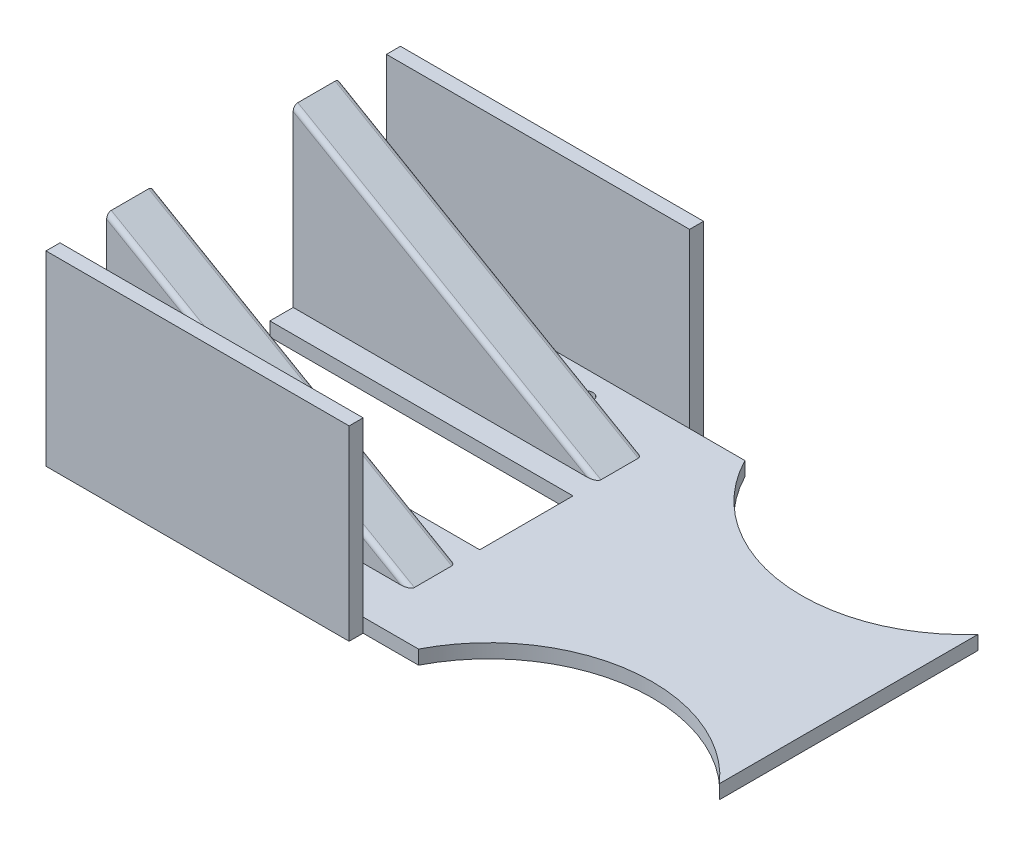
ISO-10303-21;
HEADER;
FILE_DESCRIPTION(('STEP AP214'),'2;1');
FILE_NAME('part.step','',(''),(''),'','','');
FILE_SCHEMA(('AUTOMOTIVE_DESIGN { 1 0 10303 214 1 1 1 1 }'));
ENDSEC;
DATA;
#1=APPLICATION_CONTEXT('core data for automotive mechanical design processes');
#2=APPLICATION_PROTOCOL_DEFINITION('international standard','automotive_design',2000,#1);
#3=PRODUCT_CONTEXT('',#1,'mechanical');
#4=PRODUCT('Part','Part','',(#3));
#5=PRODUCT_RELATED_PRODUCT_CATEGORY('part','',(#4));
#6=PRODUCT_DEFINITION_FORMATION('','',#4);
#7=PRODUCT_DEFINITION_CONTEXT('part definition',#1,'design');
#8=PRODUCT_DEFINITION('design','',#6,#7);
#9=PRODUCT_DEFINITION_SHAPE('','',#8);
#10=(LENGTH_UNIT() NAMED_UNIT(*) SI_UNIT(.MILLI.,.METRE.));
#11=(NAMED_UNIT(*) PLANE_ANGLE_UNIT() SI_UNIT($,.RADIAN.));
#12=(NAMED_UNIT(*) SI_UNIT($,.STERADIAN.) SOLID_ANGLE_UNIT());
#13=UNCERTAINTY_MEASURE_WITH_UNIT(LENGTH_MEASURE(1.E-05),#10,'distance_accuracy_value','');
#14=(GEOMETRIC_REPRESENTATION_CONTEXT(3) GLOBAL_UNCERTAINTY_ASSIGNED_CONTEXT((#13)) GLOBAL_UNIT_ASSIGNED_CONTEXT((#10,
#11,#12)) REPRESENTATION_CONTEXT('',''));
#15=CARTESIAN_POINT('',(0.,0.,0.));
#16=DIRECTION('',(0.,0.,1.));
#17=DIRECTION('',(1.,0.,0.));
#18=AXIS2_PLACEMENT_3D('',#15,#16,#17);
#19=CARTESIAN_POINT('',(0.,3.,0.));
#20=DIRECTION('',(0.,1.,0.));
#21=DIRECTION('',(0.,0.,1.));
#22=AXIS2_PLACEMENT_3D('',#19,#20,#21);
#23=PLANE('',#22);
#24=CARTESIAN_POINT('',(-74.7667848025547,3.,-29.8600592254599));
#25=DIRECTION('',(0.,1.,0.));
#26=DIRECTION('',(0.,0.,1.));
#27=AXIS2_PLACEMENT_3D('',#24,#25,#26);
#28=CIRCLE('',#27,1.5);
#29=CARTESIAN_POINT('',(-74.7667848025547,3.,-28.3600592254599));
#30=VERTEX_POINT('',#29);
#31=EDGE_CURVE('E568',#30,#30,#28,.T.);
#32=ORIENTED_EDGE('',*,*,#31,.F.);
#33=EDGE_LOOP('',(#32));
#34=FACE_BOUND('',#33,.T.);
#35=CARTESIAN_POINT('',(-54.7667848025547,3.,-29.8600592254599));
#36=DIRECTION('',(0.,1.,0.));
#37=DIRECTION('',(0.,0.,1.));
#38=AXIS2_PLACEMENT_3D('',#35,#36,#37);
#39=CIRCLE('',#38,1.5);
#40=CARTESIAN_POINT('',(-54.7667848025547,3.,-28.3600592254599));
#41=VERTEX_POINT('',#40);
#42=EDGE_CURVE('E593',#41,#41,#39,.T.);
#43=ORIENTED_EDGE('',*,*,#42,.F.);
#44=EDGE_LOOP('',(#43));
#45=FACE_BOUND('',#44,.T.);
#46=CARTESIAN_POINT('',(-34.7667848025547,3.,-29.8600592254599));
#47=DIRECTION('',(0.,1.,0.));
#48=DIRECTION('',(0.,0.,1.));
#49=AXIS2_PLACEMENT_3D('',#46,#47,#48);
#50=CIRCLE('',#49,1.5);
#51=CARTESIAN_POINT('',(-34.7667848025547,3.,-28.3600592254599));
#52=VERTEX_POINT('',#51);
#53=EDGE_CURVE('E585',#52,#52,#50,.T.);
#54=ORIENTED_EDGE('',*,*,#53,.F.);
#55=EDGE_LOOP('',(#54));
#56=FACE_BOUND('',#55,.T.);
#57=CARTESIAN_POINT('',(-34.7667848025547,3.,29.8600592254599));
#58=DIRECTION('',(0.,1.,0.));
#59=DIRECTION('',(0.,0.,-1.));
#60=AXIS2_PLACEMENT_3D('',#57,#58,#59);
#61=CIRCLE('',#60,1.5);
#62=CARTESIAN_POINT('',(-34.7667848025547,3.,28.3600592254599));
#63=VERTEX_POINT('',#62);
#64=EDGE_CURVE('E576',#63,#63,#61,.T.);
#65=ORIENTED_EDGE('',*,*,#64,.F.);
#66=EDGE_LOOP('',(#65));
#67=FACE_BOUND('',#66,.T.);
#68=CARTESIAN_POINT('',(-54.7667848025547,3.,29.8600592254599));
#69=DIRECTION('',(0.,1.,0.));
#70=DIRECTION('',(0.,0.,-1.));
#71=AXIS2_PLACEMENT_3D('',#68,#69,#70);
#72=CIRCLE('',#71,1.5);
#73=CARTESIAN_POINT('',(-54.7667848025547,3.,28.3600592254599));
#74=VERTEX_POINT('',#73);
#75=EDGE_CURVE('E609',#74,#74,#72,.T.);
#76=ORIENTED_EDGE('',*,*,#75,.F.);
#77=EDGE_LOOP('',(#76));
#78=FACE_BOUND('',#77,.T.);
#79=CARTESIAN_POINT('',(-74.7667848025547,3.,29.8600592254599));
#80=DIRECTION('',(0.,1.,0.));
#81=DIRECTION('',(0.,0.,-1.));
#82=AXIS2_PLACEMENT_3D('',#79,#80,#81);
#83=CIRCLE('',#82,1.5);
#84=CARTESIAN_POINT('',(-74.7667848025547,3.,28.3600592254599));
#85=VERTEX_POINT('',#84);
#86=EDGE_CURVE('E600',#85,#85,#83,.T.);
#87=ORIENTED_EDGE('',*,*,#86,.F.);
#88=EDGE_LOOP('',(#87));
#89=FACE_BOUND('',#88,.T.);
#90=CARTESIAN_POINT('',(25.2953736654804,3.,51.));
#91=DIRECTION('',(0.,1.,0.));
#92=DIRECTION('',(0.,0.,-1.));
#93=AXIS2_PLACEMENT_3D('',#90,#91,#92);
#94=CIRCLE('',#93,35.);
#95=CARTESIAN_POINT('',(51.4241384980272,3.,27.7129295890301));
#96=VERTEX_POINT('',#95);
#97=CARTESIAN_POINT('',(-5.83339116706635,3.,35.));
#98=VERTEX_POINT('',#97);
#99=EDGE_CURVE('E406',#96,#98,#94,.T.);
#100=ORIENTED_EDGE('',*,*,#99,.F.);
#101=DIRECTION('',(0.,0.,-1.));
#102=VECTOR('',#101,1.);
#103=CARTESIAN_POINT('',(51.4241384980272,3.,0.));
#104=LINE('',#103,#102);
#105=CARTESIAN_POINT('',(51.4241384980272,3.,-27.7129295890301));
#106=VERTEX_POINT('',#105);
#107=EDGE_CURVE('E221',#96,#106,#104,.T.);
#108=ORIENTED_EDGE('',*,*,#107,.T.);
#109=CARTESIAN_POINT('',(25.2953736654804,3.,-51.));
#110=DIRECTION('',(0.,1.,0.));
#111=DIRECTION('',(0.,0.,1.));
#112=AXIS2_PLACEMENT_3D('',#109,#110,#111);
#113=CIRCLE('',#112,35.);
#114=CARTESIAN_POINT('',(-5.83339116706635,3.,-35.));
#115=VERTEX_POINT('',#114);
#116=EDGE_CURVE('E409',#115,#106,#113,.T.);
#117=ORIENTED_EDGE('',*,*,#116,.F.);
#118=DIRECTION('',(-1.,0.,0.));
#119=VECTOR('',#118,1.);
#120=CARTESIAN_POINT('',(-82.7046263345196,3.,-35.));
#121=LINE('',#120,#119);
#122=CARTESIAN_POINT('',(-17.7046263345196,3.,-35.));
#123=VERTEX_POINT('',#122);
#124=EDGE_CURVE('E343',#115,#123,#121,.T.);
#125=ORIENTED_EDGE('',*,*,#124,.T.);
#126=DIRECTION('',(1.,0.,0.));
#127=VECTOR('',#126,1.);
#128=CARTESIAN_POINT('',(0.,3.,-35.));
#129=LINE('',#128,#127);
#130=CARTESIAN_POINT('',(-82.7046263345196,3.,-35.));
#131=VERTEX_POINT('',#130);
#132=EDGE_CURVE('E388',#131,#123,#129,.T.);
#133=ORIENTED_EDGE('',*,*,#132,.F.);
#134=DIRECTION('',(0.,0.,1.));
#135=VECTOR('',#134,1.);
#136=CARTESIAN_POINT('',(-82.7046263345196,3.,35.));
#137=LINE('',#136,#135);
#138=CARTESIAN_POINT('',(-82.7046263345196,3.,-25.));
#139=VERTEX_POINT('',#138);
#140=EDGE_CURVE('E348',#131,#139,#137,.T.);
#141=ORIENTED_EDGE('',*,*,#140,.T.);
#142=DIRECTION('',(1.,0.,0.));
#143=VECTOR('',#142,1.);
#144=CARTESIAN_POINT('',(-82.7046263345196,3.,-25.));
#145=LINE('',#144,#143);
#146=CARTESIAN_POINT('',(-19.7046263345196,3.,-25.));
#147=VERTEX_POINT('',#146);
#148=EDGE_CURVE('E340',#139,#147,#145,.T.);
#149=ORIENTED_EDGE('',*,*,#148,.T.);
#150=CARTESIAN_POINT('',(-19.7046263345196,3.,-24.));
#151=DIRECTION('',(0.,1.,0.));
#152=DIRECTION('',(-1.,0.,0.));
#153=AXIS2_PLACEMENT_3D('',#150,#151,#152);
#154=ELLIPSE('',#153,2.,1.);
#155=CARTESIAN_POINT('',(-17.7046263345196,3.,-24.));
#156=VERTEX_POINT('',#155);
#157=EDGE_CURVE('E297',#147,#156,#154,.F.);
#158=ORIENTED_EDGE('',*,*,#157,.T.);
#159=DIRECTION('',(0.,0.,1.));
#160=VECTOR('',#159,1.);
#161=CARTESIAN_POINT('',(-17.7046263345196,3.,-25.));
#162=LINE('',#161,#160);
#163=CARTESIAN_POINT('',(-17.7046263345196,3.,-16.));
#164=VERTEX_POINT('',#163);
#165=EDGE_CURVE('E308',#156,#164,#162,.T.);
#166=ORIENTED_EDGE('',*,*,#165,.T.);
#167=CARTESIAN_POINT('',(-19.7046263345196,3.,-16.));
#168=DIRECTION('',(0.,1.,0.));
#169=DIRECTION('',(1.,0.,0.));
#170=AXIS2_PLACEMENT_3D('',#167,#168,#169);
#171=ELLIPSE('',#170,2.,1.);
#172=CARTESIAN_POINT('',(-19.7046263345196,3.,-15.));
#173=VERTEX_POINT('',#172);
#174=EDGE_CURVE('E50',#164,#173,#171,.F.);
#175=ORIENTED_EDGE('',*,*,#174,.T.);
#176=DIRECTION('',(-1.,0.,0.));
#177=VECTOR('',#176,1.);
#178=CARTESIAN_POINT('',(137.29537366548,3.,-15.));
#179=LINE('',#178,#177);
#180=CARTESIAN_POINT('',(-82.7046263345196,3.,-15.));
#181=VERTEX_POINT('',#180);
#182=EDGE_CURVE('E305',#173,#181,#179,.T.);
#183=ORIENTED_EDGE('',*,*,#182,.T.);
#184=DIRECTION('',(0.,0.,1.));
#185=VECTOR('',#184,1.);
#186=CARTESIAN_POINT('',(-82.7046263345196,3.,-15.));
#187=LINE('',#186,#185);
#188=CARTESIAN_POINT('',(-82.7046263345196,3.,-10.));
#189=VERTEX_POINT('',#188);
#190=EDGE_CURVE('E424',#181,#189,#187,.T.);
#191=ORIENTED_EDGE('',*,*,#190,.T.);
#192=DIRECTION('',(-1.,0.,0.));
#193=VECTOR('',#192,1.);
#194=CARTESIAN_POINT('',(-82.7046263345196,3.,-10.));
#195=LINE('',#194,#193);
#196=CARTESIAN_POINT('',(-17.7046263345196,3.,-10.));
#197=VERTEX_POINT('',#196);
#198=EDGE_CURVE('E633',#197,#189,#195,.T.);
#199=ORIENTED_EDGE('',*,*,#198,.F.);
#200=DIRECTION('',(0.,0.,-1.));
#201=VECTOR('',#200,1.);
#202=CARTESIAN_POINT('',(-17.7046263345196,3.,-10.));
#203=LINE('',#202,#201);
#204=CARTESIAN_POINT('',(-17.7046263345196,3.,10.));
#205=VERTEX_POINT('',#204);
#206=EDGE_CURVE('E626',#205,#197,#203,.T.);
#207=ORIENTED_EDGE('',*,*,#206,.F.);
#208=DIRECTION('',(1.,0.,0.));
#209=VECTOR('',#208,1.);
#210=CARTESIAN_POINT('',(-82.7046263345196,3.,10.));
#211=LINE('',#210,#209);
#212=CARTESIAN_POINT('',(-82.7046263345196,3.,10.));
#213=VERTEX_POINT('',#212);
#214=EDGE_CURVE('E515',#213,#205,#211,.T.);
#215=ORIENTED_EDGE('',*,*,#214,.F.);
#216=CARTESIAN_POINT('',(-82.7046263345196,3.,15.));
#217=VERTEX_POINT('',#216);
#218=EDGE_CURVE('E423',#213,#217,#187,.T.);
#219=ORIENTED_EDGE('',*,*,#218,.T.);
#220=DIRECTION('',(-1.,0.,0.));
#221=VECTOR('',#220,1.);
#222=CARTESIAN_POINT('',(137.29537366548,3.,15.));
#223=LINE('',#222,#221);
#224=CARTESIAN_POINT('',(-19.7046263345196,3.,15.));
#225=VERTEX_POINT('',#224);
#226=EDGE_CURVE('E318',#225,#217,#223,.T.);
#227=ORIENTED_EDGE('',*,*,#226,.F.);
#228=CARTESIAN_POINT('',(-19.7046263345196,3.,16.));
#229=DIRECTION('',(0.,1.,0.));
#230=DIRECTION('',(-1.,0.,0.));
#231=AXIS2_PLACEMENT_3D('',#228,#229,#230);
#232=ELLIPSE('',#231,2.,1.);
#233=CARTESIAN_POINT('',(-17.7046263345196,3.,16.));
#234=VERTEX_POINT('',#233);
#235=EDGE_CURVE('E11',#225,#234,#232,.F.);
#236=ORIENTED_EDGE('',*,*,#235,.T.);
#237=CARTESIAN_POINT('',(-17.7046263345196,3.,24.));
#238=VERTEX_POINT('',#237);
#239=EDGE_CURVE('E332',#234,#238,#162,.T.);
#240=ORIENTED_EDGE('',*,*,#239,.T.);
#241=CARTESIAN_POINT('',(-19.7046263345196,3.,24.));
#242=DIRECTION('',(0.,1.,0.));
#243=DIRECTION('',(1.,0.,0.));
#244=AXIS2_PLACEMENT_3D('',#241,#242,#243);
#245=ELLIPSE('',#244,2.,1.);
#246=CARTESIAN_POINT('',(-19.7046263345196,3.,25.));
#247=VERTEX_POINT('',#246);
#248=EDGE_CURVE('E294',#238,#247,#245,.F.);
#249=ORIENTED_EDGE('',*,*,#248,.T.);
#250=DIRECTION('',(1.,0.,0.));
#251=VECTOR('',#250,1.);
#252=CARTESIAN_POINT('',(-82.7046263345196,3.,25.));
#253=LINE('',#252,#251);
#254=CARTESIAN_POINT('',(-82.7046263345196,3.,25.));
#255=VERTEX_POINT('',#254);
#256=EDGE_CURVE('E436',#255,#247,#253,.T.);
#257=ORIENTED_EDGE('',*,*,#256,.F.);
#258=CARTESIAN_POINT('',(-82.7046263345196,3.,35.));
#259=VERTEX_POINT('',#258);
#260=EDGE_CURVE('E347',#255,#259,#137,.T.);
#261=ORIENTED_EDGE('',*,*,#260,.T.);
#262=DIRECTION('',(1.,0.,0.));
#263=VECTOR('',#262,1.);
#264=CARTESIAN_POINT('',(-82.7046263345196,3.,35.));
#265=LINE('',#264,#263);
#266=CARTESIAN_POINT('',(-17.7046263345196,3.,35.));
#267=VERTEX_POINT('',#266);
#268=EDGE_CURVE('E242',#259,#267,#265,.T.);
#269=ORIENTED_EDGE('',*,*,#268,.T.);
#270=EDGE_CURVE('E249',#267,#98,#265,.T.);
#271=ORIENTED_EDGE('',*,*,#270,.T.);
#272=EDGE_LOOP('',(#100,#108,#117,#125,#133,#141,#149,#158,#166,#175,#183,#191,#199,#207,#215,
#219,#227,#236,#240,#249,#257,#261,#269,#271));
#273=FACE_BOUND('',#272,.T.);
#274=ADVANCED_FACE('F41',(#34,#45,#56,#67,#78,#89,#273),#23,.T.);
#275=CARTESIAN_POINT('',(0.,0.,0.));
#276=DIRECTION('',(0.,1.,0.));
#277=DIRECTION('',(0.,0.,1.));
#278=AXIS2_PLACEMENT_3D('',#275,#276,#277);
#279=PLANE('',#278);
#280=CARTESIAN_POINT('',(-74.7667848025547,0.,-29.8600592254599));
#281=DIRECTION('',(0.,1.,0.));
#282=DIRECTION('',(0.,0.,1.));
#283=AXIS2_PLACEMENT_3D('',#280,#281,#282);
#284=CIRCLE('',#283,1.5);
#285=CARTESIAN_POINT('',(-74.7667848025547,0.,-28.3600592254599));
#286=VERTEX_POINT('',#285);
#287=EDGE_CURVE('E553',#286,#286,#284,.T.);
#288=ORIENTED_EDGE('',*,*,#287,.T.);
#289=EDGE_LOOP('',(#288));
#290=FACE_BOUND('',#289,.T.);
#291=CARTESIAN_POINT('',(-54.7667848025547,0.,-29.8600592254599));
#292=DIRECTION('',(0.,1.,0.));
#293=DIRECTION('',(0.,0.,1.));
#294=AXIS2_PLACEMENT_3D('',#291,#292,#293);
#295=CIRCLE('',#294,1.5);
#296=CARTESIAN_POINT('',(-54.7667848025547,0.,-28.3600592254599));
#297=VERTEX_POINT('',#296);
#298=EDGE_CURVE('E572',#297,#297,#295,.T.);
#299=ORIENTED_EDGE('',*,*,#298,.T.);
#300=EDGE_LOOP('',(#299));
#301=FACE_BOUND('',#300,.T.);
#302=CARTESIAN_POINT('',(-34.7667848025547,0.,-29.8600592254599));
#303=DIRECTION('',(0.,1.,0.));
#304=DIRECTION('',(0.,0.,1.));
#305=AXIS2_PLACEMENT_3D('',#302,#303,#304);
#306=CIRCLE('',#305,1.5);
#307=CARTESIAN_POINT('',(-34.7667848025547,0.,-28.3600592254599));
#308=VERTEX_POINT('',#307);
#309=EDGE_CURVE('E589',#308,#308,#306,.T.);
#310=ORIENTED_EDGE('',*,*,#309,.T.);
#311=EDGE_LOOP('',(#310));
#312=FACE_BOUND('',#311,.T.);
#313=CARTESIAN_POINT('',(-34.7667848025547,0.,29.8600592254599));
#314=DIRECTION('',(0.,1.,0.));
#315=DIRECTION('',(0.,0.,-1.));
#316=AXIS2_PLACEMENT_3D('',#313,#314,#315);
#317=CIRCLE('',#316,1.5);
#318=CARTESIAN_POINT('',(-34.7667848025547,0.,28.3600592254599));
#319=VERTEX_POINT('',#318);
#320=EDGE_CURVE('E580',#319,#319,#317,.T.);
#321=ORIENTED_EDGE('',*,*,#320,.T.);
#322=EDGE_LOOP('',(#321));
#323=FACE_BOUND('',#322,.T.);
#324=CARTESIAN_POINT('',(-54.7667848025547,0.,29.8600592254599));
#325=DIRECTION('',(0.,1.,0.));
#326=DIRECTION('',(0.,0.,-1.));
#327=AXIS2_PLACEMENT_3D('',#324,#325,#326);
#328=CIRCLE('',#327,1.5);
#329=CARTESIAN_POINT('',(-54.7667848025547,0.,28.3600592254599));
#330=VERTEX_POINT('',#329);
#331=EDGE_CURVE('E581',#330,#330,#328,.T.);
#332=ORIENTED_EDGE('',*,*,#331,.T.);
#333=EDGE_LOOP('',(#332));
#334=FACE_BOUND('',#333,.T.);
#335=CARTESIAN_POINT('',(-74.7667848025547,0.,29.8600592254599));
#336=DIRECTION('',(0.,1.,0.));
#337=DIRECTION('',(0.,0.,-1.));
#338=AXIS2_PLACEMENT_3D('',#335,#336,#337);
#339=CIRCLE('',#338,1.5);
#340=CARTESIAN_POINT('',(-74.7667848025547,0.,28.3600592254599));
#341=VERTEX_POINT('',#340);
#342=EDGE_CURVE('E604',#341,#341,#339,.T.);
#343=ORIENTED_EDGE('',*,*,#342,.T.);
#344=EDGE_LOOP('',(#343));
#345=FACE_BOUND('',#344,.T.);
#346=DIRECTION('',(0.,0.,-1.));
#347=VECTOR('',#346,1.);
#348=CARTESIAN_POINT('',(51.4241384980272,0.,0.));
#349=LINE('',#348,#347);
#350=CARTESIAN_POINT('',(51.4241384980272,0.,27.7129295890301));
#351=VERTEX_POINT('',#350);
#352=CARTESIAN_POINT('',(51.4241384980272,0.,-27.7129295890301));
#353=VERTEX_POINT('',#352);
#354=EDGE_CURVE('E57',#351,#353,#349,.T.);
#355=ORIENTED_EDGE('',*,*,#354,.F.);
#356=CARTESIAN_POINT('',(25.2953736654804,0.,51.));
#357=DIRECTION('',(0.,1.,0.));
#358=DIRECTION('',(0.,0.,1.));
#359=AXIS2_PLACEMENT_3D('',#356,#357,#358);
#360=CIRCLE('',#359,35.);
#361=CARTESIAN_POINT('',(-5.83339116706635,0.,35.));
#362=VERTEX_POINT('',#361);
#363=EDGE_CURVE('E231',#351,#362,#360,.T.);
#364=ORIENTED_EDGE('',*,*,#363,.T.);
#365=DIRECTION('',(1.,0.,0.));
#366=VECTOR('',#365,1.);
#367=CARTESIAN_POINT('',(-82.7046263345196,0.,35.));
#368=LINE('',#367,#366);
#369=CARTESIAN_POINT('',(-17.7046263345196,0.,35.));
#370=VERTEX_POINT('',#369);
#371=EDGE_CURVE('E252',#370,#362,#368,.T.);
#372=ORIENTED_EDGE('',*,*,#371,.F.);
#373=DIRECTION('',(0.,0.,1.));
#374=VECTOR('',#373,1.);
#375=CARTESIAN_POINT('',(-17.7046263345196,0.,38.));
#376=LINE('',#375,#374);
#377=CARTESIAN_POINT('',(-17.7046263345196,0.,38.));
#378=VERTEX_POINT('',#377);
#379=EDGE_CURVE('E376',#370,#378,#376,.T.);
#380=ORIENTED_EDGE('',*,*,#379,.T.);
#381=DIRECTION('',(-1.,0.,0.));
#382=VECTOR('',#381,1.);
#383=CARTESIAN_POINT('',(-17.7046263345196,0.,38.));
#384=LINE('',#383,#382);
#385=CARTESIAN_POINT('',(-82.7046263345196,0.,38.));
#386=VERTEX_POINT('',#385);
#387=EDGE_CURVE('E374',#378,#386,#384,.T.);
#388=ORIENTED_EDGE('',*,*,#387,.T.);
#389=DIRECTION('',(0.,0.,1.));
#390=VECTOR('',#389,1.);
#391=CARTESIAN_POINT('',(-82.7046263345196,0.,35.));
#392=LINE('',#391,#390);
#393=CARTESIAN_POINT('',(-82.7046263345196,0.,10.));
#394=VERTEX_POINT('',#393);
#395=EDGE_CURVE('E354',#394,#386,#392,.T.);
#396=ORIENTED_EDGE('',*,*,#395,.F.);
#397=DIRECTION('',(1.,0.,0.));
#398=VECTOR('',#397,1.);
#399=CARTESIAN_POINT('',(-82.7046263345196,0.,10.));
#400=LINE('',#399,#398);
#401=CARTESIAN_POINT('',(-17.7046263345196,0.,10.));
#402=VERTEX_POINT('',#401);
#403=EDGE_CURVE('E638',#394,#402,#400,.T.);
#404=ORIENTED_EDGE('',*,*,#403,.T.);
#405=DIRECTION('',(0.,0.,-1.));
#406=VECTOR('',#405,1.);
#407=CARTESIAN_POINT('',(-17.7046263345196,0.,-10.));
#408=LINE('',#407,#406);
#409=CARTESIAN_POINT('',(-17.7046263345196,0.,-10.));
#410=VERTEX_POINT('',#409);
#411=EDGE_CURVE('E65',#402,#410,#408,.T.);
#412=ORIENTED_EDGE('',*,*,#411,.T.);
#413=DIRECTION('',(-1.,0.,0.));
#414=VECTOR('',#413,1.);
#415=CARTESIAN_POINT('',(-82.7046263345196,0.,-10.));
#416=LINE('',#415,#414);
#417=CARTESIAN_POINT('',(-82.7046263345196,0.,-10.));
#418=VERTEX_POINT('',#417);
#419=EDGE_CURVE('E630',#410,#418,#416,.T.);
#420=ORIENTED_EDGE('',*,*,#419,.T.);
#421=CARTESIAN_POINT('',(-82.7046263345196,0.,-38.));
#422=VERTEX_POINT('',#421);
#423=EDGE_CURVE('E355',#422,#418,#392,.T.);
#424=ORIENTED_EDGE('',*,*,#423,.F.);
#425=DIRECTION('',(-1.,0.,0.));
#426=VECTOR('',#425,1.);
#427=CARTESIAN_POINT('',(-17.7046263345196,0.,-38.));
#428=LINE('',#427,#426);
#429=CARTESIAN_POINT('',(-17.7046263345196,0.,-38.));
#430=VERTEX_POINT('',#429);
#431=EDGE_CURVE('E531',#430,#422,#428,.T.);
#432=ORIENTED_EDGE('',*,*,#431,.F.);
#433=DIRECTION('',(0.,0.,1.));
#434=VECTOR('',#433,1.);
#435=CARTESIAN_POINT('',(-17.7046263345196,0.,-38.));
#436=LINE('',#435,#434);
#437=CARTESIAN_POINT('',(-17.7046263345196,0.,-35.));
#438=VERTEX_POINT('',#437);
#439=EDGE_CURVE('E561',#430,#438,#436,.T.);
#440=ORIENTED_EDGE('',*,*,#439,.T.);
#441=DIRECTION('',(-1.,0.,0.));
#442=VECTOR('',#441,1.);
#443=CARTESIAN_POINT('',(-82.7046263345196,0.,-35.));
#444=LINE('',#443,#442);
#445=CARTESIAN_POINT('',(-5.83339116706635,0.,-35.));
#446=VERTEX_POINT('',#445);
#447=EDGE_CURVE('E352',#446,#438,#444,.T.);
#448=ORIENTED_EDGE('',*,*,#447,.F.);
#449=CARTESIAN_POINT('',(25.2953736654804,0.,-51.));
#450=DIRECTION('',(0.,1.,0.));
#451=DIRECTION('',(0.,0.,1.));
#452=AXIS2_PLACEMENT_3D('',#449,#450,#451);
#453=CIRCLE('',#452,35.);
#454=EDGE_CURVE('E234',#446,#353,#453,.T.);
#455=ORIENTED_EDGE('',*,*,#454,.T.);
#456=EDGE_LOOP('',(#355,#364,#372,#380,#388,#396,#404,#412,#420,#424,#432,#440,#448,#455));
#457=FACE_BOUND('',#456,.T.);
#458=ADVANCED_FACE('F230',(#290,#301,#312,#323,#334,#345,#457),#279,.F.);
#459=CARTESIAN_POINT('',(25.2953736654804,0.,51.));
#460=DIRECTION('',(0.,1.,0.));
#461=DIRECTION('',(0.,0.,1.));
#462=AXIS2_PLACEMENT_3D('',#459,#460,#461);
#463=CYLINDRICAL_SURFACE('',#462,35.);
#464=DIRECTION('',(0.,1.,0.));
#465=VECTOR('',#464,1.);
#466=CARTESIAN_POINT('',(51.4241384980272,0.,27.7129295890301));
#467=LINE('',#466,#465);
#468=EDGE_CURVE('E218',#351,#96,#467,.T.);
#469=ORIENTED_EDGE('',*,*,#468,.T.);
#470=ORIENTED_EDGE('',*,*,#99,.T.);
#471=DIRECTION('',(0.,1.,0.));
#472=VECTOR('',#471,1.);
#473=CARTESIAN_POINT('',(-5.83339116706635,0.,35.));
#474=LINE('',#473,#472);
#475=EDGE_CURVE('E240',#362,#98,#474,.T.);
#476=ORIENTED_EDGE('',*,*,#475,.F.);
#477=ORIENTED_EDGE('',*,*,#363,.F.);
#478=EDGE_LOOP('',(#469,#470,#476,#477));
#479=FACE_BOUND('',#478,.T.);
#480=ADVANCED_FACE('F238',(#479),#463,.F.);
#481=CARTESIAN_POINT('',(25.2953736654804,0.,-51.));
#482=DIRECTION('',(0.,1.,0.));
#483=DIRECTION('',(0.,0.,1.));
#484=AXIS2_PLACEMENT_3D('',#481,#482,#483);
#485=CYLINDRICAL_SURFACE('',#484,35.);
#486=DIRECTION('',(0.,1.,0.));
#487=VECTOR('',#486,1.);
#488=CARTESIAN_POINT('',(51.4241384980272,0.,-27.7129295890301));
#489=LINE('',#488,#487);
#490=EDGE_CURVE('E226',#353,#106,#489,.T.);
#491=ORIENTED_EDGE('',*,*,#490,.F.);
#492=ORIENTED_EDGE('',*,*,#454,.F.);
#493=DIRECTION('',(0.,1.,0.));
#494=VECTOR('',#493,1.);
#495=CARTESIAN_POINT('',(-5.83339116706635,0.,-35.));
#496=LINE('',#495,#494);
#497=EDGE_CURVE('E417',#115,#446,#496,.F.);
#498=ORIENTED_EDGE('',*,*,#497,.F.);
#499=ORIENTED_EDGE('',*,*,#116,.T.);
#500=EDGE_LOOP('',(#491,#492,#498,#499));
#501=FACE_BOUND('',#500,.T.);
#502=ADVANCED_FACE('F651',(#501),#485,.F.);
#503=CARTESIAN_POINT('',(-82.7046263345196,3.,35.));
#504=DIRECTION('',(1.,0.,0.));
#505=DIRECTION('',(0.,0.,-1.));
#506=AXIS2_PLACEMENT_3D('',#503,#504,#505);
#507=PLANE('',#506);
#508=ORIENTED_EDGE('',*,*,#423,.T.);
#509=DIRECTION('',(0.,1.,0.));
#510=VECTOR('',#509,1.);
#511=CARTESIAN_POINT('',(-82.7046263345196,0.,-10.));
#512=LINE('',#511,#510);
#513=EDGE_CURVE('E616',#418,#189,#512,.T.);
#514=ORIENTED_EDGE('',*,*,#513,.T.);
#515=ORIENTED_EDGE('',*,*,#190,.F.);
#516=DIRECTION('',(0.,-1.,0.));
#517=VECTOR('',#516,1.);
#518=CARTESIAN_POINT('',(-82.7046263345196,40.5277674973258,-15.));
#519=LINE('',#518,#517);
#520=CARTESIAN_POINT('',(-82.7046263345196,39.3730669589465,-15.));
#521=VERTEX_POINT('',#520);
#522=EDGE_CURVE('E315',#521,#181,#519,.T.);
#523=ORIENTED_EDGE('',*,*,#522,.F.);
#524=CARTESIAN_POINT('',(-82.7046263345196,39.3730669589465,-16.));
#525=DIRECTION('',(1.,0.,0.));
#526=DIRECTION('',(0.,-1.,0.));
#527=AXIS2_PLACEMENT_3D('',#524,#525,#526);
#528=ELLIPSE('',#527,1.15470053837925,1.);
#529=CARTESIAN_POINT('',(-82.7046263345196,40.5277674973258,-16.));
#530=VERTEX_POINT('',#529);
#531=EDGE_CURVE('E261',#521,#530,#528,.F.);
#532=ORIENTED_EDGE('',*,*,#531,.T.);
#533=DIRECTION('',(0.,0.,1.));
#534=VECTOR('',#533,1.);
#535=CARTESIAN_POINT('',(-82.7046263345196,40.5277674973258,-25.));
#536=LINE('',#535,#534);
#537=CARTESIAN_POINT('',(-82.7046263345196,40.5277674973258,-24.));
#538=VERTEX_POINT('',#537);
#539=EDGE_CURVE('E327',#538,#530,#536,.T.);
#540=ORIENTED_EDGE('',*,*,#539,.F.);
#541=CARTESIAN_POINT('',(-82.7046263345196,39.3730669589465,-24.));
#542=DIRECTION('',(1.,0.,0.));
#543=DIRECTION('',(0.,1.,0.));
#544=AXIS2_PLACEMENT_3D('',#541,#542,#543);
#545=ELLIPSE('',#544,1.15470053837925,1.);
#546=CARTESIAN_POINT('',(-82.7046263345196,39.3730669589465,-25.));
#547=VERTEX_POINT('',#546);
#548=EDGE_CURVE('E264',#538,#547,#545,.F.);
#549=ORIENTED_EDGE('',*,*,#548,.T.);
#550=DIRECTION('',(0.,-1.,0.));
#551=VECTOR('',#550,1.);
#552=CARTESIAN_POINT('',(-82.7046263345196,40.5277674973258,-25.));
#553=LINE('',#552,#551);
#554=EDGE_CURVE('E440',#547,#139,#553,.T.);
#555=ORIENTED_EDGE('',*,*,#554,.T.);
#556=ORIENTED_EDGE('',*,*,#140,.F.);
#557=DIRECTION('',(0.,1.,0.));
#558=VECTOR('',#557,1.);
#559=CARTESIAN_POINT('',(-82.7046263345196,0.,-35.));
#560=LINE('',#559,#558);
#561=CARTESIAN_POINT('',(-82.7046263345196,40.,-35.));
#562=VERTEX_POINT('',#561);
#563=EDGE_CURVE('E547',#131,#562,#560,.T.);
#564=ORIENTED_EDGE('',*,*,#563,.T.);
#565=DIRECTION('',(0.,0.,-1.));
#566=VECTOR('',#565,1.);
#567=CARTESIAN_POINT('',(-82.7046263345196,40.,-35.));
#568=LINE('',#567,#566);
#569=CARTESIAN_POINT('',(-82.7046263345196,40.,-38.));
#570=VERTEX_POINT('',#569);
#571=EDGE_CURVE('E542',#562,#570,#568,.T.);
#572=ORIENTED_EDGE('',*,*,#571,.T.);
#573=DIRECTION('',(0.,-1.,0.));
#574=VECTOR('',#573,1.);
#575=CARTESIAN_POINT('',(-82.7046263345196,40.,-38.));
#576=LINE('',#575,#574);
#577=EDGE_CURVE('E550',#570,#422,#576,.T.);
#578=ORIENTED_EDGE('',*,*,#577,.T.);
#579=EDGE_LOOP('',(#508,#514,#515,#523,#532,#540,#549,#555,#556,#564,#572,#578));
#580=FACE_BOUND('',#579,.T.);
#581=ADVANCED_FACE('F326',(#580),#507,.F.);
#582=CARTESIAN_POINT('',(-82.7046263345196,3.,-35.));
#583=DIRECTION('',(0.,0.,1.));
#584=DIRECTION('',(1.,0.,0.));
#585=AXIS2_PLACEMENT_3D('',#582,#583,#584);
#586=PLANE('',#585);
#587=DIRECTION('',(0.,1.,0.));
#588=VECTOR('',#587,1.);
#589=CARTESIAN_POINT('',(-17.7046263345196,0.,-35.));
#590=LINE('',#589,#588);
#591=EDGE_CURVE('E557',#438,#123,#590,.T.);
#592=ORIENTED_EDGE('',*,*,#591,.T.);
#593=ORIENTED_EDGE('',*,*,#124,.F.);
#594=ORIENTED_EDGE('',*,*,#497,.T.);
#595=ORIENTED_EDGE('',*,*,#447,.T.);
#596=EDGE_LOOP('',(#592,#593,#594,#595));
#597=FACE_BOUND('',#596,.T.);
#598=ADVANCED_FACE('F479',(#597),#586,.F.);
#599=CARTESIAN_POINT('',(-82.7046263345196,3.,35.));
#600=DIRECTION('',(0.,0.,-1.));
#601=DIRECTION('',(-1.,0.,0.));
#602=AXIS2_PLACEMENT_3D('',#599,#600,#601);
#603=PLANE('',#602);
#604=ORIENTED_EDGE('',*,*,#270,.F.);
#605=DIRECTION('',(0.,-1.,0.));
#606=VECTOR('',#605,1.);
#607=CARTESIAN_POINT('',(-17.7046263345196,0.,35.));
#608=LINE('',#607,#606);
#609=EDGE_CURVE('E520',#267,#370,#608,.T.);
#610=ORIENTED_EDGE('',*,*,#609,.T.);
#611=ORIENTED_EDGE('',*,*,#371,.T.);
#612=ORIENTED_EDGE('',*,*,#475,.T.);
#613=EDGE_LOOP('',(#604,#610,#611,#612));
#614=FACE_BOUND('',#613,.T.);
#615=ADVANCED_FACE('F476',(#614),#603,.F.);
#616=CARTESIAN_POINT('',(-82.7046263345196,40.5277674973258,-25.));
#617=DIRECTION('',(0.500000000000001,0.866025403784438,0.));
#618=DIRECTION('',(-0.866025403784438,0.500000000000001,0.));
#619=AXIS2_PLACEMENT_3D('',#616,#617,#618);
#620=PLANE('',#619);
#621=CARTESIAN_POINT('',(-82.7046263345196,40.5277674973258,16.));
#622=VERTEX_POINT('',#621);
#623=CARTESIAN_POINT('',(-82.7046263345196,40.5277674973258,24.));
#624=VERTEX_POINT('',#623);
#625=EDGE_CURVE('E333',#622,#624,#536,.T.);
#626=ORIENTED_EDGE('',*,*,#625,.T.);
#627=DIRECTION('',(-0.866025403784438,0.500000000000001,0.));
#628=VECTOR('',#627,1.);
#629=CARTESIAN_POINT('',(-17.7046263345196,3.,24.));
#630=LINE('',#629,#628);
#631=EDGE_CURVE('E273',#624,#238,#630,.F.);
#632=ORIENTED_EDGE('',*,*,#631,.T.);
#633=ORIENTED_EDGE('',*,*,#239,.F.);
#634=DIRECTION('',(0.866025403784438,-0.500000000000001,0.));
#635=VECTOR('',#634,1.);
#636=CARTESIAN_POINT('',(-82.7046263345196,40.5277674973258,16.));
#637=LINE('',#636,#635);
#638=EDGE_CURVE('E270',#234,#622,#637,.F.);
#639=ORIENTED_EDGE('',*,*,#638,.T.);
#640=EDGE_LOOP('',(#626,#632,#633,#639));
#641=FACE_BOUND('',#640,.T.);
#642=ADVANCED_FACE('F464',(#641),#620,.T.);
#643=ORIENTED_EDGE('',*,*,#218,.F.);
#644=DIRECTION('',(0.,1.,0.));
#645=VECTOR('',#644,1.);
#646=CARTESIAN_POINT('',(-82.7046263345196,0.,10.));
#647=LINE('',#646,#645);
#648=EDGE_CURVE('E371',#394,#213,#647,.T.);
#649=ORIENTED_EDGE('',*,*,#648,.F.);
#650=ORIENTED_EDGE('',*,*,#395,.T.);
#651=DIRECTION('',(0.,1.,0.));
#652=VECTOR('',#651,1.);
#653=CARTESIAN_POINT('',(-82.7046263345196,40.,38.));
#654=LINE('',#653,#652);
#655=CARTESIAN_POINT('',(-82.7046263345196,40.,38.));
#656=VERTEX_POINT('',#655);
#657=EDGE_CURVE('E370',#386,#656,#654,.T.);
#658=ORIENTED_EDGE('',*,*,#657,.T.);
#659=DIRECTION('',(0.,0.,-1.));
#660=VECTOR('',#659,1.);
#661=CARTESIAN_POINT('',(-82.7046263345196,40.,35.));
#662=LINE('',#661,#660);
#663=CARTESIAN_POINT('',(-82.7046263345196,40.,35.));
#664=VERTEX_POINT('',#663);
#665=EDGE_CURVE('E387',#656,#664,#662,.T.);
#666=ORIENTED_EDGE('',*,*,#665,.T.);
#667=DIRECTION('',(0.,-1.,0.));
#668=VECTOR('',#667,1.);
#669=CARTESIAN_POINT('',(-82.7046263345196,0.,35.));
#670=LINE('',#669,#668);
#671=EDGE_CURVE('E392',#664,#259,#670,.T.);
#672=ORIENTED_EDGE('',*,*,#671,.T.);
#673=ORIENTED_EDGE('',*,*,#260,.F.);
#674=DIRECTION('',(0.,-1.,0.));
#675=VECTOR('',#674,1.);
#676=CARTESIAN_POINT('',(-82.7046263345196,40.5277674973258,25.));
#677=LINE('',#676,#675);
#678=CARTESIAN_POINT('',(-82.7046263345196,39.3730669589465,25.));
#679=VERTEX_POINT('',#678);
#680=EDGE_CURVE('E432',#679,#255,#677,.T.);
#681=ORIENTED_EDGE('',*,*,#680,.F.);
#682=CARTESIAN_POINT('',(-82.7046263345196,39.3730669589465,24.));
#683=DIRECTION('',(1.,0.,0.));
#684=DIRECTION('',(0.,-1.,0.));
#685=AXIS2_PLACEMENT_3D('',#682,#683,#684);
#686=ELLIPSE('',#685,1.15470053837925,1.);
#687=EDGE_CURVE('E267',#679,#624,#686,.F.);
#688=ORIENTED_EDGE('',*,*,#687,.T.);
#689=ORIENTED_EDGE('',*,*,#625,.F.);
#690=CARTESIAN_POINT('',(-82.7046263345196,39.3730669589465,16.));
#691=DIRECTION('',(1.,0.,0.));
#692=DIRECTION('',(0.,1.,0.));
#693=AXIS2_PLACEMENT_3D('',#690,#691,#692);
#694=ELLIPSE('',#693,1.15470053837925,1.);
#695=CARTESIAN_POINT('',(-82.7046263345196,39.3730669589465,15.));
#696=VERTEX_POINT('',#695);
#697=EDGE_CURVE('E258',#622,#696,#694,.F.);
#698=ORIENTED_EDGE('',*,*,#697,.T.);
#699=DIRECTION('',(0.,1.,0.));
#700=VECTOR('',#699,1.);
#701=CARTESIAN_POINT('',(-82.7046263345196,3.,15.));
#702=LINE('',#701,#700);
#703=EDGE_CURVE('E319',#217,#696,#702,.T.);
#704=ORIENTED_EDGE('',*,*,#703,.F.);
#705=EDGE_LOOP('',(#643,#649,#650,#658,#666,#672,#673,#681,#688,#689,#698,#704));
#706=FACE_BOUND('',#705,.T.);
#707=ADVANCED_FACE('F367',(#706),#507,.F.);
#708=ORIENTED_EDGE('',*,*,#165,.F.);
#709=DIRECTION('',(-0.866025403784438,0.500000000000001,0.));
#710=VECTOR('',#709,1.);
#711=CARTESIAN_POINT('',(-82.7046263345196,40.5277674973258,-24.));
#712=LINE('',#711,#710);
#713=EDGE_CURVE('E279',#156,#538,#712,.T.);
#714=ORIENTED_EDGE('',*,*,#713,.T.);
#715=ORIENTED_EDGE('',*,*,#539,.T.);
#716=DIRECTION('',(-0.866025403784438,0.500000000000001,0.));
#717=VECTOR('',#716,1.);
#718=CARTESIAN_POINT('',(-17.7046263345196,3.,-16.));
#719=LINE('',#718,#717);
#720=EDGE_CURVE('E276',#530,#164,#719,.F.);
#721=ORIENTED_EDGE('',*,*,#720,.T.);
#722=EDGE_LOOP('',(#708,#714,#715,#721));
#723=FACE_BOUND('',#722,.T.);
#724=ADVANCED_FACE('F329',(#723),#620,.T.);
#725=CARTESIAN_POINT('',(0.,0.,-25.));
#726=DIRECTION('',(0.,0.,-1.));
#727=DIRECTION('',(-1.,0.,0.));
#728=AXIS2_PLACEMENT_3D('',#725,#726,#727);
#729=PLANE('',#728);
#730=ORIENTED_EDGE('',*,*,#554,.F.);
#731=DIRECTION('',(-0.866025403784438,0.500000000000001,0.));
#732=VECTOR('',#731,1.);
#733=CARTESIAN_POINT('',(-3.62711847795325,-6.28235348888691,-25.));
#734=LINE('',#733,#732);
#735=EDGE_CURVE('E283',#547,#147,#734,.F.);
#736=ORIENTED_EDGE('',*,*,#735,.T.);
#737=ORIENTED_EDGE('',*,*,#148,.F.);
#738=EDGE_LOOP('',(#730,#736,#737));
#739=FACE_BOUND('',#738,.T.);
#740=ADVANCED_FACE('F452',(#739),#729,.T.);
#741=CARTESIAN_POINT('',(0.,0.,25.));
#742=DIRECTION('',(0.,0.,-1.));
#743=DIRECTION('',(-1.,0.,0.));
#744=AXIS2_PLACEMENT_3D('',#741,#742,#743);
#745=PLANE('',#744);
#746=ORIENTED_EDGE('',*,*,#256,.T.);
#747=DIRECTION('',(-0.866025403784438,0.500000000000001,0.));
#748=VECTOR('',#747,1.);
#749=CARTESIAN_POINT('',(-83.2046263345196,39.6617420935413,25.));
#750=LINE('',#749,#748);
#751=EDGE_CURVE('E246',#247,#679,#750,.T.);
#752=ORIENTED_EDGE('',*,*,#751,.T.);
#753=ORIENTED_EDGE('',*,*,#680,.T.);
#754=EDGE_LOOP('',(#746,#752,#753));
#755=FACE_BOUND('',#754,.T.);
#756=ADVANCED_FACE('F454',(#755),#745,.F.);
#757=CARTESIAN_POINT('',(137.29537366548,3.,15.));
#758=DIRECTION('',(0.,0.,1.));
#759=DIRECTION('',(0.,-1.,0.));
#760=AXIS2_PLACEMENT_3D('',#757,#758,#759);
#761=PLANE('',#760);
#762=ORIENTED_EDGE('',*,*,#703,.T.);
#763=DIRECTION('',(0.866025403784438,-0.500000000000001,0.));
#764=VECTOR('',#763,1.);
#765=CARTESIAN_POINT('',(-18.2046263345196,2.13397459621556,15.));
#766=LINE('',#765,#764);
#767=EDGE_CURVE('E290',#696,#225,#766,.T.);
#768=ORIENTED_EDGE('',*,*,#767,.T.);
#769=ORIENTED_EDGE('',*,*,#226,.T.);
#770=EDGE_LOOP('',(#762,#768,#769));
#771=FACE_BOUND('',#770,.T.);
#772=ADVANCED_FACE('F460',(#771),#761,.F.);
#773=CARTESIAN_POINT('',(137.29537366548,40.5277674973258,-15.));
#774=DIRECTION('',(0.,0.,-1.));
#775=DIRECTION('',(0.,1.,0.));
#776=AXIS2_PLACEMENT_3D('',#773,#774,#775);
#777=PLANE('',#776);
#778=ORIENTED_EDGE('',*,*,#182,.F.);
#779=DIRECTION('',(-0.866025403784438,0.500000000000001,0.));
#780=VECTOR('',#779,1.);
#781=CARTESIAN_POINT('',(-83.2046263345196,39.6617420935413,-15.));
#782=LINE('',#781,#780);
#783=EDGE_CURVE('E286',#173,#521,#782,.T.);
#784=ORIENTED_EDGE('',*,*,#783,.T.);
#785=ORIENTED_EDGE('',*,*,#522,.T.);
#786=EDGE_LOOP('',(#778,#784,#785));
#787=FACE_BOUND('',#786,.T.);
#788=ADVANCED_FACE('F313',(#787),#777,.F.);
#789=CARTESIAN_POINT('',(-17.7046263345196,0.,35.));
#790=DIRECTION('',(0.,0.,-1.));
#791=DIRECTION('',(-1.,0.,0.));
#792=AXIS2_PLACEMENT_3D('',#789,#790,#791);
#793=PLANE('',#792);
#794=CARTESIAN_POINT('',(-17.7046263345196,40.,35.));
#795=VERTEX_POINT('',#794);
#796=EDGE_CURVE('E382',#795,#267,#608,.T.);
#797=ORIENTED_EDGE('',*,*,#796,.T.);
#798=ORIENTED_EDGE('',*,*,#268,.F.);
#799=ORIENTED_EDGE('',*,*,#671,.F.);
#800=DIRECTION('',(-1.,0.,0.));
#801=VECTOR('',#800,1.);
#802=CARTESIAN_POINT('',(-17.7046263345196,40.,35.));
#803=LINE('',#802,#801);
#804=EDGE_CURVE('E403',#795,#664,#803,.T.);
#805=ORIENTED_EDGE('',*,*,#804,.F.);
#806=EDGE_LOOP('',(#797,#798,#799,#805));
#807=FACE_BOUND('',#806,.T.);
#808=ADVANCED_FACE('F686',(#807),#793,.T.);
#809=CARTESIAN_POINT('',(-17.7046263345196,40.,35.));
#810=DIRECTION('',(0.,1.,0.));
#811=DIRECTION('',(0.,0.,1.));
#812=AXIS2_PLACEMENT_3D('',#809,#810,#811);
#813=PLANE('',#812);
#814=ORIENTED_EDGE('',*,*,#665,.F.);
#815=DIRECTION('',(-1.,0.,0.));
#816=VECTOR('',#815,1.);
#817=CARTESIAN_POINT('',(-17.7046263345196,40.,38.));
#818=LINE('',#817,#816);
#819=CARTESIAN_POINT('',(-17.7046263345196,40.,38.));
#820=VERTEX_POINT('',#819);
#821=EDGE_CURVE('E381',#820,#656,#818,.T.);
#822=ORIENTED_EDGE('',*,*,#821,.F.);
#823=DIRECTION('',(0.,0.,-1.));
#824=VECTOR('',#823,1.);
#825=CARTESIAN_POINT('',(-17.7046263345196,40.,35.));
#826=LINE('',#825,#824);
#827=EDGE_CURVE('E523',#820,#795,#826,.T.);
#828=ORIENTED_EDGE('',*,*,#827,.T.);
#829=ORIENTED_EDGE('',*,*,#804,.T.);
#830=EDGE_LOOP('',(#814,#822,#828,#829));
#831=FACE_BOUND('',#830,.T.);
#832=ADVANCED_FACE('F689',(#831),#813,.T.);
#833=CARTESIAN_POINT('',(-17.7046263345196,40.,38.));
#834=DIRECTION('',(0.,0.,1.));
#835=DIRECTION('',(0.,-1.,0.));
#836=AXIS2_PLACEMENT_3D('',#833,#834,#835);
#837=PLANE('',#836);
#838=ORIENTED_EDGE('',*,*,#657,.F.);
#839=ORIENTED_EDGE('',*,*,#387,.F.);
#840=DIRECTION('',(0.,1.,0.));
#841=VECTOR('',#840,1.);
#842=CARTESIAN_POINT('',(-17.7046263345196,40.,38.));
#843=LINE('',#842,#841);
#844=EDGE_CURVE('E526',#378,#820,#843,.T.);
#845=ORIENTED_EDGE('',*,*,#844,.T.);
#846=ORIENTED_EDGE('',*,*,#821,.T.);
#847=EDGE_LOOP('',(#838,#839,#845,#846));
#848=FACE_BOUND('',#847,.T.);
#849=ADVANCED_FACE('F384',(#848),#837,.T.);
#850=CARTESIAN_POINT('',(-17.7046263345196,0.,0.));
#851=DIRECTION('',(1.,0.,0.));
#852=DIRECTION('',(0.,0.,-1.));
#853=AXIS2_PLACEMENT_3D('',#850,#851,#852);
#854=PLANE('',#853);
#855=ORIENTED_EDGE('',*,*,#379,.F.);
#856=ORIENTED_EDGE('',*,*,#609,.F.);
#857=ORIENTED_EDGE('',*,*,#796,.F.);
#858=ORIENTED_EDGE('',*,*,#827,.F.);
#859=ORIENTED_EDGE('',*,*,#844,.F.);
#860=EDGE_LOOP('',(#855,#856,#857,#858,#859));
#861=FACE_BOUND('',#860,.T.);
#862=ADVANCED_FACE('F682',(#861),#854,.T.);
#863=CARTESIAN_POINT('',(-17.7046263345196,40.,-38.));
#864=DIRECTION('',(0.,0.,-1.));
#865=DIRECTION('',(0.,1.,0.));
#866=AXIS2_PLACEMENT_3D('',#863,#864,#865);
#867=PLANE('',#866);
#868=ORIENTED_EDGE('',*,*,#577,.F.);
#869=DIRECTION('',(-1.,0.,0.));
#870=VECTOR('',#869,1.);
#871=CARTESIAN_POINT('',(-17.7046263345196,40.,-38.));
#872=LINE('',#871,#870);
#873=CARTESIAN_POINT('',(-17.7046263345196,40.,-38.));
#874=VERTEX_POINT('',#873);
#875=EDGE_CURVE('E395',#874,#570,#872,.T.);
#876=ORIENTED_EDGE('',*,*,#875,.F.);
#877=DIRECTION('',(0.,-1.,0.));
#878=VECTOR('',#877,1.);
#879=CARTESIAN_POINT('',(-17.7046263345196,40.,-38.));
#880=LINE('',#879,#878);
#881=EDGE_CURVE('E546',#874,#430,#880,.T.);
#882=ORIENTED_EDGE('',*,*,#881,.T.);
#883=ORIENTED_EDGE('',*,*,#431,.T.);
#884=EDGE_LOOP('',(#868,#876,#882,#883));
#885=FACE_BOUND('',#884,.T.);
#886=ADVANCED_FACE('F661',(#885),#867,.T.);
#887=CARTESIAN_POINT('',(-17.7046263345196,40.,-35.));
#888=DIRECTION('',(0.,1.,0.));
#889=DIRECTION('',(0.,0.,1.));
#890=AXIS2_PLACEMENT_3D('',#887,#888,#889);
#891=PLANE('',#890);
#892=ORIENTED_EDGE('',*,*,#571,.F.);
#893=DIRECTION('',(-1.,0.,0.));
#894=VECTOR('',#893,1.);
#895=CARTESIAN_POINT('',(-17.7046263345196,40.,-35.));
#896=LINE('',#895,#894);
#897=CARTESIAN_POINT('',(-17.7046263345196,40.,-35.));
#898=VERTEX_POINT('',#897);
#899=EDGE_CURVE('E535',#898,#562,#896,.T.);
#900=ORIENTED_EDGE('',*,*,#899,.F.);
#901=DIRECTION('',(0.,0.,-1.));
#902=VECTOR('',#901,1.);
#903=CARTESIAN_POINT('',(-17.7046263345196,40.,-35.));
#904=LINE('',#903,#902);
#905=EDGE_CURVE('E536',#898,#874,#904,.T.);
#906=ORIENTED_EDGE('',*,*,#905,.T.);
#907=ORIENTED_EDGE('',*,*,#875,.T.);
#908=EDGE_LOOP('',(#892,#900,#906,#907));
#909=FACE_BOUND('',#908,.T.);
#910=ADVANCED_FACE('F664',(#909),#891,.T.);
#911=CARTESIAN_POINT('',(-17.7046263345196,0.,-35.));
#912=DIRECTION('',(0.,0.,1.));
#913=DIRECTION('',(1.,0.,0.));
#914=AXIS2_PLACEMENT_3D('',#911,#912,#913);
#915=PLANE('',#914);
#916=ORIENTED_EDGE('',*,*,#563,.F.);
#917=ORIENTED_EDGE('',*,*,#132,.T.);
#918=EDGE_CURVE('E560',#123,#898,#590,.T.);
#919=ORIENTED_EDGE('',*,*,#918,.T.);
#920=ORIENTED_EDGE('',*,*,#899,.T.);
#921=EDGE_LOOP('',(#916,#917,#919,#920));
#922=FACE_BOUND('',#921,.T.);
#923=ADVANCED_FACE('F669',(#922),#915,.T.);
#924=CARTESIAN_POINT('',(-17.7046263345196,0.,0.));
#925=DIRECTION('',(-1.,0.,0.));
#926=DIRECTION('',(0.,0.,1.));
#927=AXIS2_PLACEMENT_3D('',#924,#925,#926);
#928=PLANE('',#927);
#929=ORIENTED_EDGE('',*,*,#881,.F.);
#930=ORIENTED_EDGE('',*,*,#905,.F.);
#931=ORIENTED_EDGE('',*,*,#918,.F.);
#932=ORIENTED_EDGE('',*,*,#591,.F.);
#933=ORIENTED_EDGE('',*,*,#439,.F.);
#934=EDGE_LOOP('',(#929,#930,#931,#932,#933));
#935=FACE_BOUND('',#934,.T.);
#936=ADVANCED_FACE('F656',(#935),#928,.F.);
#937=CARTESIAN_POINT('',(-74.7667848025547,0.,-29.8600592254599));
#938=DIRECTION('',(0.,1.,0.));
#939=DIRECTION('',(0.,0.,1.));
#940=AXIS2_PLACEMENT_3D('',#937,#938,#939);
#941=CYLINDRICAL_SURFACE('',#940,1.5);
#942=ORIENTED_EDGE('',*,*,#287,.F.);
#943=EDGE_LOOP('',(#942));
#944=FACE_BOUND('',#943,.T.);
#945=ORIENTED_EDGE('',*,*,#31,.T.);
#946=EDGE_LOOP('',(#945));
#947=FACE_BOUND('',#946,.T.);
#948=ADVANCED_FACE('F676',(#944,#947),#941,.F.);
#949=CARTESIAN_POINT('',(-54.7667848025547,0.,-29.8600592254599));
#950=DIRECTION('',(0.,1.,0.));
#951=DIRECTION('',(0.,0.,1.));
#952=AXIS2_PLACEMENT_3D('',#949,#950,#951);
#953=CYLINDRICAL_SURFACE('',#952,1.5);
#954=ORIENTED_EDGE('',*,*,#298,.F.);
#955=EDGE_LOOP('',(#954));
#956=FACE_BOUND('',#955,.T.);
#957=ORIENTED_EDGE('',*,*,#42,.T.);
#958=EDGE_LOOP('',(#957));
#959=FACE_BOUND('',#958,.T.);
#960=ADVANCED_FACE('F752',(#956,#959),#953,.F.);
#961=CARTESIAN_POINT('',(-34.7667848025547,0.,-29.8600592254599));
#962=DIRECTION('',(0.,1.,0.));
#963=DIRECTION('',(0.,0.,1.));
#964=AXIS2_PLACEMENT_3D('',#961,#962,#963);
#965=CYLINDRICAL_SURFACE('',#964,1.5);
#966=ORIENTED_EDGE('',*,*,#309,.F.);
#967=EDGE_LOOP('',(#966));
#968=FACE_BOUND('',#967,.T.);
#969=ORIENTED_EDGE('',*,*,#53,.T.);
#970=EDGE_LOOP('',(#969));
#971=FACE_BOUND('',#970,.T.);
#972=ADVANCED_FACE('F762',(#968,#971),#965,.F.);
#973=CARTESIAN_POINT('',(-34.7667848025547,0.,29.8600592254599));
#974=DIRECTION('',(0.,1.,0.));
#975=DIRECTION('',(0.,0.,1.));
#976=AXIS2_PLACEMENT_3D('',#973,#974,#975);
#977=CYLINDRICAL_SURFACE('',#976,1.5);
#978=ORIENTED_EDGE('',*,*,#320,.F.);
#979=EDGE_LOOP('',(#978));
#980=FACE_BOUND('',#979,.T.);
#981=ORIENTED_EDGE('',*,*,#64,.T.);
#982=EDGE_LOOP('',(#981));
#983=FACE_BOUND('',#982,.T.);
#984=ADVANCED_FACE('F772',(#980,#983),#977,.F.);
#985=CARTESIAN_POINT('',(-54.7667848025547,0.,29.8600592254599));
#986=DIRECTION('',(0.,1.,0.));
#987=DIRECTION('',(0.,0.,1.));
#988=AXIS2_PLACEMENT_3D('',#985,#986,#987);
#989=CYLINDRICAL_SURFACE('',#988,1.5);
#990=ORIENTED_EDGE('',*,*,#331,.F.);
#991=EDGE_LOOP('',(#990));
#992=FACE_BOUND('',#991,.T.);
#993=ORIENTED_EDGE('',*,*,#75,.T.);
#994=EDGE_LOOP('',(#993));
#995=FACE_BOUND('',#994,.T.);
#996=ADVANCED_FACE('F782',(#992,#995),#989,.F.);
#997=CARTESIAN_POINT('',(-74.7667848025547,0.,29.8600592254599));
#998=DIRECTION('',(0.,1.,0.));
#999=DIRECTION('',(0.,0.,1.));
#1000=AXIS2_PLACEMENT_3D('',#997,#998,#999);
#1001=CYLINDRICAL_SURFACE('',#1000,1.5);
#1002=ORIENTED_EDGE('',*,*,#342,.F.);
#1003=EDGE_LOOP('',(#1002));
#1004=FACE_BOUND('',#1003,.T.);
#1005=ORIENTED_EDGE('',*,*,#86,.T.);
#1006=EDGE_LOOP('',(#1005));
#1007=FACE_BOUND('',#1006,.T.);
#1008=ADVANCED_FACE('F489',(#1004,#1007),#1001,.F.);
#1009=CARTESIAN_POINT('',(-3.62711847795325,-6.2823534888869,24.));
#1010=DIRECTION('',(0.866025403784438,-0.500000000000001,0.));
#1011=DIRECTION('',(0.500000000000001,0.866025403784438,0.));
#1012=AXIS2_PLACEMENT_3D('',#1009,#1010,#1011);
#1013=CYLINDRICAL_SURFACE('',#1012,1.);
#1014=ORIENTED_EDGE('',*,*,#248,.F.);
#1015=ORIENTED_EDGE('',*,*,#631,.F.);
#1016=ORIENTED_EDGE('',*,*,#687,.F.);
#1017=ORIENTED_EDGE('',*,*,#751,.F.);
#1018=EDGE_LOOP('',(#1014,#1015,#1016,#1017));
#1019=FACE_BOUND('',#1018,.T.);
#1020=ADVANCED_FACE('F486',(#1019),#1013,.T.);
#1021=CARTESIAN_POINT('',(-83.2046263345196,39.6617420935413,-24.));
#1022=DIRECTION('',(-0.866025403784438,0.500000000000001,0.));
#1023=DIRECTION('',(-0.500000000000001,-0.866025403784438,0.));
#1024=AXIS2_PLACEMENT_3D('',#1021,#1022,#1023);
#1025=CYLINDRICAL_SURFACE('',#1024,1.);
#1026=ORIENTED_EDGE('',*,*,#157,.F.);
#1027=ORIENTED_EDGE('',*,*,#735,.F.);
#1028=ORIENTED_EDGE('',*,*,#548,.F.);
#1029=ORIENTED_EDGE('',*,*,#713,.F.);
#1030=EDGE_LOOP('',(#1026,#1027,#1028,#1029));
#1031=FACE_BOUND('',#1030,.T.);
#1032=ADVANCED_FACE('F451',(#1031),#1025,.T.);
#1033=CARTESIAN_POINT('',(81.7953736654802,-55.6010523227471,-16.));
#1034=DIRECTION('',(0.866025403784438,-0.500000000000001,0.));
#1035=DIRECTION('',(0.500000000000001,0.866025403784438,0.));
#1036=AXIS2_PLACEMENT_3D('',#1033,#1034,#1035);
#1037=CYLINDRICAL_SURFACE('',#1036,1.);
#1038=ORIENTED_EDGE('',*,*,#174,.F.);
#1039=ORIENTED_EDGE('',*,*,#720,.F.);
#1040=ORIENTED_EDGE('',*,*,#531,.F.);
#1041=ORIENTED_EDGE('',*,*,#783,.F.);
#1042=EDGE_LOOP('',(#1038,#1039,#1040,#1041));
#1043=FACE_BOUND('',#1042,.T.);
#1044=ADVANCED_FACE('F321',(#1043),#1037,.T.);
#1045=CARTESIAN_POINT('',(98.0453736654803,-64.9829941970785,16.));
#1046=DIRECTION('',(-0.866025403784438,0.500000000000001,0.));
#1047=DIRECTION('',(-0.500000000000001,-0.866025403784438,0.));
#1048=AXIS2_PLACEMENT_3D('',#1045,#1046,#1047);
#1049=CYLINDRICAL_SURFACE('',#1048,1.);
#1050=ORIENTED_EDGE('',*,*,#697,.F.);
#1051=ORIENTED_EDGE('',*,*,#638,.F.);
#1052=ORIENTED_EDGE('',*,*,#235,.F.);
#1053=ORIENTED_EDGE('',*,*,#767,.F.);
#1054=EDGE_LOOP('',(#1050,#1051,#1052,#1053));
#1055=FACE_BOUND('',#1054,.T.);
#1056=ADVANCED_FACE('F43',(#1055),#1049,.T.);
#1057=CARTESIAN_POINT('',(-82.7046263345196,0.,-10.));
#1058=DIRECTION('',(0.,0.,-1.));
#1059=DIRECTION('',(-1.,0.,0.));
#1060=AXIS2_PLACEMENT_3D('',#1057,#1058,#1059);
#1061=PLANE('',#1060);
#1062=ORIENTED_EDGE('',*,*,#198,.T.);
#1063=ORIENTED_EDGE('',*,*,#513,.F.);
#1064=ORIENTED_EDGE('',*,*,#419,.F.);
#1065=DIRECTION('',(0.,1.,0.));
#1066=VECTOR('',#1065,1.);
#1067=CARTESIAN_POINT('',(-17.7046263345196,0.,-10.));
#1068=LINE('',#1067,#1066);
#1069=EDGE_CURVE('E605',#410,#197,#1068,.T.);
#1070=ORIENTED_EDGE('',*,*,#1069,.T.);
#1071=EDGE_LOOP('',(#1062,#1063,#1064,#1070));
#1072=FACE_BOUND('',#1071,.T.);
#1073=ADVANCED_FACE('F496',(#1072),#1061,.F.);
#1074=CARTESIAN_POINT('',(-17.7046263345196,0.,-10.));
#1075=DIRECTION('',(1.,0.,0.));
#1076=DIRECTION('',(0.,0.,-1.));
#1077=AXIS2_PLACEMENT_3D('',#1074,#1075,#1076);
#1078=PLANE('',#1077);
#1079=ORIENTED_EDGE('',*,*,#206,.T.);
#1080=ORIENTED_EDGE('',*,*,#1069,.F.);
#1081=ORIENTED_EDGE('',*,*,#411,.F.);
#1082=DIRECTION('',(0.,1.,0.));
#1083=VECTOR('',#1082,1.);
#1084=CARTESIAN_POINT('',(-17.7046263345196,0.,10.));
#1085=LINE('',#1084,#1083);
#1086=EDGE_CURVE('E621',#402,#205,#1085,.T.);
#1087=ORIENTED_EDGE('',*,*,#1086,.T.);
#1088=EDGE_LOOP('',(#1079,#1080,#1081,#1087));
#1089=FACE_BOUND('',#1088,.T.);
#1090=ADVANCED_FACE('F501',(#1089),#1078,.F.);
#1091=CARTESIAN_POINT('',(-82.7046263345196,0.,10.));
#1092=DIRECTION('',(0.,0.,1.));
#1093=DIRECTION('',(1.,0.,0.));
#1094=AXIS2_PLACEMENT_3D('',#1091,#1092,#1093);
#1095=PLANE('',#1094);
#1096=ORIENTED_EDGE('',*,*,#214,.T.);
#1097=ORIENTED_EDGE('',*,*,#1086,.F.);
#1098=ORIENTED_EDGE('',*,*,#403,.F.);
#1099=ORIENTED_EDGE('',*,*,#648,.T.);
#1100=EDGE_LOOP('',(#1096,#1097,#1098,#1099));
#1101=FACE_BOUND('',#1100,.T.);
#1102=ADVANCED_FACE('F883',(#1101),#1095,.F.);
#1103=CARTESIAN_POINT('',(51.4241384980272,0.,0.));
#1104=DIRECTION('',(1.,0.,0.));
#1105=DIRECTION('',(0.,0.,-1.));
#1106=AXIS2_PLACEMENT_3D('',#1103,#1104,#1105);
#1107=PLANE('',#1106);
#1108=ORIENTED_EDGE('',*,*,#107,.F.);
#1109=ORIENTED_EDGE('',*,*,#468,.F.);
#1110=ORIENTED_EDGE('',*,*,#354,.T.);
#1111=ORIENTED_EDGE('',*,*,#490,.T.);
#1112=EDGE_LOOP('',(#1108,#1109,#1110,#1111));
#1113=FACE_BOUND('',#1112,.T.);
#1114=ADVANCED_FACE('F219',(#1113),#1107,.T.);
#1115=CLOSED_SHELL('',(#274,#458,#480,#502,#581,#598,#615,#642,#707,#724,#740,#756,#772,#788,
#808,#832,#849,#862,#886,#910,#923,#936,#948,#960,#972,#984,#996,#1008,#1020,#1032,#1044,#1056,
#1073,#1090,#1102,#1114));
#1116=MANIFOLD_SOLID_BREP('B2',#1115);
#1117=ADVANCED_BREP_SHAPE_REPRESENTATION('',(#18,#1116),#14);
#1118=SHAPE_DEFINITION_REPRESENTATION(#9,#1117);
ENDSEC;
END-ISO-10303-21;
